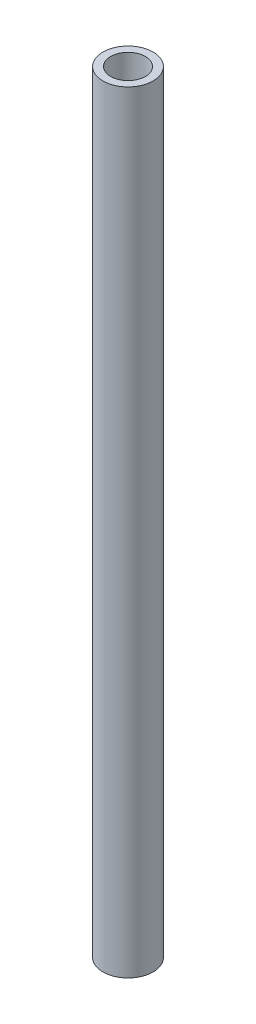
ISO-10303-21;
HEADER;
FILE_DESCRIPTION(('STEP AP214'),'2;1');
FILE_NAME('part.step','',(''),(''),'','','');
FILE_SCHEMA(('AUTOMOTIVE_DESIGN { 1 0 10303 214 1 1 1 1 }'));
ENDSEC;
DATA;
#1=APPLICATION_CONTEXT('core data for automotive mechanical design processes');
#2=APPLICATION_PROTOCOL_DEFINITION('international standard','automotive_design',2000,#1);
#3=PRODUCT_CONTEXT('',#1,'mechanical');
#4=PRODUCT('Part','Part','',(#3));
#5=PRODUCT_RELATED_PRODUCT_CATEGORY('part','',(#4));
#6=PRODUCT_DEFINITION_FORMATION('','',#4);
#7=PRODUCT_DEFINITION_CONTEXT('part definition',#1,'design');
#8=PRODUCT_DEFINITION('design','',#6,#7);
#9=PRODUCT_DEFINITION_SHAPE('','',#8);
#10=(LENGTH_UNIT() NAMED_UNIT(*) SI_UNIT(.MILLI.,.METRE.));
#11=(NAMED_UNIT(*) PLANE_ANGLE_UNIT() SI_UNIT($,.RADIAN.));
#12=(NAMED_UNIT(*) SI_UNIT($,.STERADIAN.) SOLID_ANGLE_UNIT());
#13=UNCERTAINTY_MEASURE_WITH_UNIT(LENGTH_MEASURE(1.E-05),#10,'distance_accuracy_value','');
#14=(GEOMETRIC_REPRESENTATION_CONTEXT(3) GLOBAL_UNCERTAINTY_ASSIGNED_CONTEXT((#13)) GLOBAL_UNIT_ASSIGNED_CONTEXT((#10,
#11,#12)) REPRESENTATION_CONTEXT('',''));
#15=CARTESIAN_POINT('',(0.,0.,0.));
#16=DIRECTION('',(0.,0.,1.));
#17=DIRECTION('',(1.,0.,0.));
#18=AXIS2_PLACEMENT_3D('',#15,#16,#17);
#19=CARTESIAN_POINT('',(0.,200.,0.));
#20=DIRECTION('',(0.,1.,0.));
#21=DIRECTION('',(0.,0.,1.));
#22=AXIS2_PLACEMENT_3D('',#19,#20,#21);
#23=PLANE('',#22);
#24=CARTESIAN_POINT('',(0.,200.,0.));
#25=DIRECTION('',(0.,1.,0.));
#26=DIRECTION('',(1.,0.,0.));
#27=AXIS2_PLACEMENT_3D('',#24,#25,#26);
#28=CIRCLE('',#27,6.5);
#29=CARTESIAN_POINT('',(6.5,200.,0.));
#30=VERTEX_POINT('',#29);
#31=EDGE_CURVE('E11',#30,#30,#28,.T.);
#32=ORIENTED_EDGE('',*,*,#31,.T.);
#33=EDGE_LOOP('',(#32));
#34=FACE_BOUND('',#33,.T.);
#35=CARTESIAN_POINT('',(0.,200.,0.));
#36=DIRECTION('',(0.,1.,0.));
#37=DIRECTION('',(0.,0.,1.));
#38=AXIS2_PLACEMENT_3D('',#35,#36,#37);
#39=CIRCLE('',#38,4.5);
#40=CARTESIAN_POINT('',(0.,200.,4.5));
#41=VERTEX_POINT('',#40);
#42=EDGE_CURVE('E48',#41,#41,#39,.T.);
#43=ORIENTED_EDGE('',*,*,#42,.F.);
#44=EDGE_LOOP('',(#43));
#45=FACE_BOUND('',#44,.T.);
#46=ADVANCED_FACE('F37',(#34,#45),#23,.T.);
#47=CARTESIAN_POINT('',(0.,0.,0.));
#48=DIRECTION('',(0.,1.,0.));
#49=DIRECTION('',(0.,0.,1.));
#50=AXIS2_PLACEMENT_3D('',#47,#48,#49);
#51=PLANE('',#50);
#52=CARTESIAN_POINT('',(0.,0.,0.));
#53=DIRECTION('',(0.,1.,0.));
#54=DIRECTION('',(1.,0.,0.));
#55=AXIS2_PLACEMENT_3D('',#52,#53,#54);
#56=CIRCLE('',#55,6.5);
#57=CARTESIAN_POINT('',(6.5,0.,0.));
#58=VERTEX_POINT('',#57);
#59=EDGE_CURVE('E41',#58,#58,#56,.T.);
#60=ORIENTED_EDGE('',*,*,#59,.F.);
#61=EDGE_LOOP('',(#60));
#62=FACE_BOUND('',#61,.T.);
#63=CARTESIAN_POINT('',(0.,0.,0.));
#64=DIRECTION('',(0.,1.,0.));
#65=DIRECTION('',(0.,0.,1.));
#66=AXIS2_PLACEMENT_3D('',#63,#64,#65);
#67=CIRCLE('',#66,4.5);
#68=CARTESIAN_POINT('',(0.,0.,4.5));
#69=VERTEX_POINT('',#68);
#70=EDGE_CURVE('E50',#69,#69,#67,.T.);
#71=ORIENTED_EDGE('',*,*,#70,.T.);
#72=EDGE_LOOP('',(#71));
#73=FACE_BOUND('',#72,.T.);
#74=ADVANCED_FACE('F60',(#62,#73),#51,.F.);
#75=CARTESIAN_POINT('',(0.,200.,0.));
#76=DIRECTION('',(0.,-1.,0.));
#77=DIRECTION('',(0.,0.,-1.));
#78=AXIS2_PLACEMENT_3D('',#75,#76,#77);
#79=CYLINDRICAL_SURFACE('',#78,6.5);
#80=ORIENTED_EDGE('',*,*,#31,.F.);
#81=EDGE_LOOP('',(#80));
#82=FACE_BOUND('',#81,.T.);
#83=ORIENTED_EDGE('',*,*,#59,.T.);
#84=EDGE_LOOP('',(#83));
#85=FACE_BOUND('',#84,.T.);
#86=ADVANCED_FACE('F39',(#82,#85),#79,.T.);
#87=CARTESIAN_POINT('',(0.,200.,0.));
#88=DIRECTION('',(0.,-1.,0.));
#89=DIRECTION('',(0.,0.,-1.));
#90=AXIS2_PLACEMENT_3D('',#87,#88,#89);
#91=CYLINDRICAL_SURFACE('',#90,4.5);
#92=ORIENTED_EDGE('',*,*,#42,.T.);
#93=EDGE_LOOP('',(#92));
#94=FACE_BOUND('',#93,.T.);
#95=ORIENTED_EDGE('',*,*,#70,.F.);
#96=EDGE_LOOP('',(#95));
#97=FACE_BOUND('',#96,.T.);
#98=ADVANCED_FACE('F56',(#94,#97),#91,.F.);
#99=CLOSED_SHELL('',(#46,#74,#86,#98));
#100=MANIFOLD_SOLID_BREP('B2',#99);
#101=ADVANCED_BREP_SHAPE_REPRESENTATION('',(#18,#100),#14);
#102=SHAPE_DEFINITION_REPRESENTATION(#9,#101);
ENDSEC;
END-ISO-10303-21;
